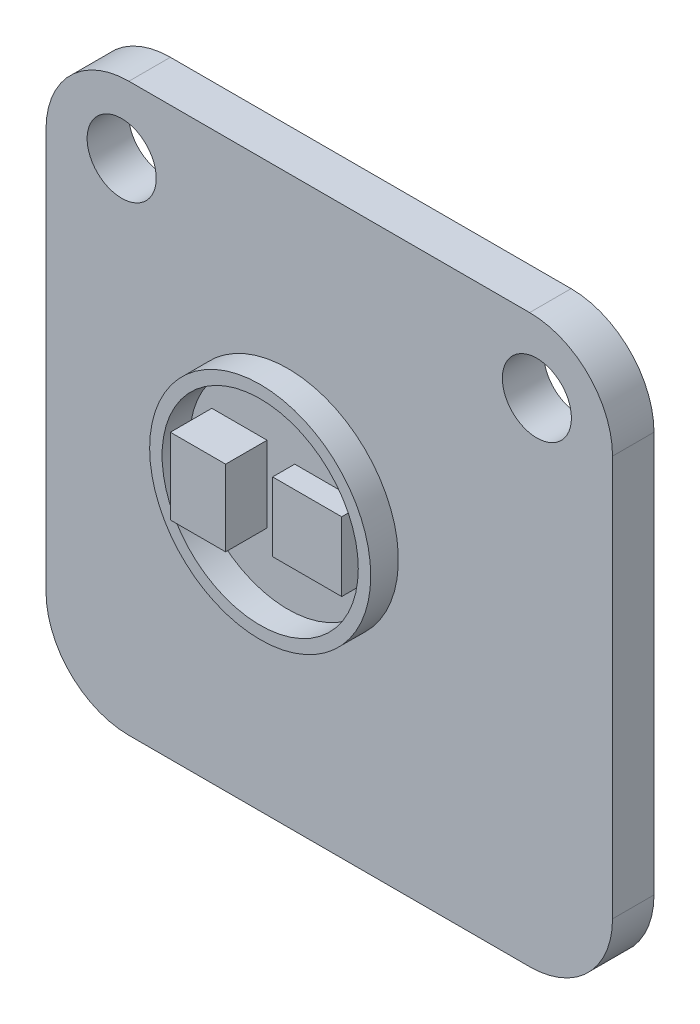
ISO-10303-21;
HEADER;
FILE_DESCRIPTION(('STEP AP214'),'2;1');
FILE_NAME('part.step','',(''),(''),'','','');
FILE_SCHEMA(('AUTOMOTIVE_DESIGN { 1 0 10303 214 1 1 1 1 }'));
ENDSEC;
DATA;
#1=APPLICATION_CONTEXT('core data for automotive mechanical design processes');
#2=APPLICATION_PROTOCOL_DEFINITION('international standard','automotive_design',2000,#1);
#3=PRODUCT_CONTEXT('',#1,'mechanical');
#4=PRODUCT('Part','Part','',(#3));
#5=PRODUCT_RELATED_PRODUCT_CATEGORY('part','',(#4));
#6=PRODUCT_DEFINITION_FORMATION('','',#4);
#7=PRODUCT_DEFINITION_CONTEXT('part definition',#1,'design');
#8=PRODUCT_DEFINITION('design','',#6,#7);
#9=PRODUCT_DEFINITION_SHAPE('','',#8);
#10=(LENGTH_UNIT() NAMED_UNIT(*) SI_UNIT(.MILLI.,.METRE.));
#11=(NAMED_UNIT(*) PLANE_ANGLE_UNIT() SI_UNIT($,.RADIAN.));
#12=(NAMED_UNIT(*) SI_UNIT($,.STERADIAN.) SOLID_ANGLE_UNIT());
#13=UNCERTAINTY_MEASURE_WITH_UNIT(LENGTH_MEASURE(1.E-05),#10,'distance_accuracy_value','');
#14=(GEOMETRIC_REPRESENTATION_CONTEXT(3) GLOBAL_UNCERTAINTY_ASSIGNED_CONTEXT((#13)) GLOBAL_UNIT_ASSIGNED_CONTEXT((#10,
#11,#12)) REPRESENTATION_CONTEXT('',''));
#15=CARTESIAN_POINT('',(0.,0.,0.));
#16=DIRECTION('',(0.,0.,1.));
#17=DIRECTION('',(1.,0.,0.));
#18=AXIS2_PLACEMENT_3D('',#15,#16,#17);
#19=CARTESIAN_POINT('',(0.,0.,1.5));
#20=DIRECTION('',(0.,0.,-1.));
#21=DIRECTION('',(-1.,0.,0.));
#22=AXIS2_PLACEMENT_3D('',#19,#20,#21);
#23=PLANE('',#22);
#24=DIRECTION('',(0.,1.,0.));
#25=VECTOR('',#24,1.);
#26=CARTESIAN_POINT('',(11.5,11.5,1.5));
#27=LINE('',#26,#25);
#28=CARTESIAN_POINT('',(11.5,9.,1.5));
#29=VERTEX_POINT('',#28);
#30=CARTESIAN_POINT('',(11.5,11.5,1.5));
#31=VERTEX_POINT('',#30);
#32=EDGE_CURVE('E173',#29,#31,#27,.T.);
#33=ORIENTED_EDGE('',*,*,#32,.F.);
#34=DIRECTION('',(1.,0.,0.));
#35=VECTOR('',#34,1.);
#36=CARTESIAN_POINT('',(9.,9.,1.5));
#37=LINE('',#36,#35);
#38=CARTESIAN_POINT('',(9.,9.,1.5));
#39=VERTEX_POINT('',#38);
#40=EDGE_CURVE('E199',#39,#29,#37,.T.);
#41=ORIENTED_EDGE('',*,*,#40,.F.);
#42=DIRECTION('',(0.,-1.,0.));
#43=VECTOR('',#42,1.);
#44=CARTESIAN_POINT('',(9.,11.5,1.5));
#45=LINE('',#44,#43);
#46=CARTESIAN_POINT('',(9.,11.5,1.5));
#47=VERTEX_POINT('',#46);
#48=EDGE_CURVE('E211',#47,#39,#45,.T.);
#49=ORIENTED_EDGE('',*,*,#48,.F.);
#50=DIRECTION('',(-1.,0.,0.));
#51=VECTOR('',#50,1.);
#52=CARTESIAN_POINT('',(9.,11.5,1.5));
#53=LINE('',#52,#51);
#54=EDGE_CURVE('E208',#31,#47,#53,.T.);
#55=ORIENTED_EDGE('',*,*,#54,.F.);
#56=EDGE_LOOP('',(#33,#41,#49,#55));
#57=FACE_BOUND('',#56,.T.);
#58=DIRECTION('',(1.,0.,0.));
#59=VECTOR('',#58,1.);
#60=CARTESIAN_POINT('',(6.,9.,1.5));
#61=LINE('',#60,#59);
#62=CARTESIAN_POINT('',(6.,9.,1.5));
#63=VERTEX_POINT('',#62);
#64=CARTESIAN_POINT('',(8.,9.,1.5));
#65=VERTEX_POINT('',#64);
#66=EDGE_CURVE('E171',#63,#65,#61,.T.);
#67=ORIENTED_EDGE('',*,*,#66,.F.);
#68=DIRECTION('',(0.,-1.,0.));
#69=VECTOR('',#68,1.);
#70=CARTESIAN_POINT('',(6.,11.75,1.5));
#71=LINE('',#70,#69);
#72=CARTESIAN_POINT('',(6.,11.75,1.5));
#73=VERTEX_POINT('',#72);
#74=EDGE_CURVE('E166',#73,#63,#71,.T.);
#75=ORIENTED_EDGE('',*,*,#74,.F.);
#76=DIRECTION('',(1.,0.,0.));
#77=VECTOR('',#76,1.);
#78=CARTESIAN_POINT('',(6.,11.75,1.5));
#79=LINE('',#78,#77);
#80=CARTESIAN_POINT('',(8.,11.75,1.5));
#81=VERTEX_POINT('',#80);
#82=EDGE_CURVE('E62',#73,#81,#79,.T.);
#83=ORIENTED_EDGE('',*,*,#82,.T.);
#84=DIRECTION('',(0.,-1.,0.));
#85=VECTOR('',#84,1.);
#86=CARTESIAN_POINT('',(8.,11.75,1.5));
#87=LINE('',#86,#85);
#88=EDGE_CURVE('E57',#81,#65,#87,.T.);
#89=ORIENTED_EDGE('',*,*,#88,.T.);
#90=EDGE_LOOP('',(#67,#75,#83,#89));
#91=FACE_BOUND('',#90,.T.);
#92=CARTESIAN_POINT('',(8.75,10.375,1.5));
#93=DIRECTION('',(0.,0.,1.));
#94=DIRECTION('',(1.,0.,0.));
#95=AXIS2_PLACEMENT_3D('',#92,#93,#94);
#96=CIRCLE('',#95,3.55);
#97=CARTESIAN_POINT('',(12.3,10.375,1.5));
#98=VERTEX_POINT('',#97);
#99=EDGE_CURVE('E333',#98,#98,#96,.T.);
#100=ORIENTED_EDGE('',*,*,#99,.T.);
#101=EDGE_LOOP('',(#100));
#102=FACE_BOUND('',#101,.T.);
#103=ADVANCED_FACE('F42',(#57,#91,#102),#23,.F.);
#104=CARTESIAN_POINT('',(11.5,11.5,2.3));
#105=DIRECTION('',(-1.,0.,0.));
#106=DIRECTION('',(0.,0.,1.));
#107=AXIS2_PLACEMENT_3D('',#104,#105,#106);
#108=PLANE('',#107);
#109=ORIENTED_EDGE('',*,*,#32,.T.);
#110=DIRECTION('',(0.,0.,-1.));
#111=VECTOR('',#110,1.);
#112=CARTESIAN_POINT('',(11.5,11.5,2.3));
#113=LINE('',#112,#111);
#114=CARTESIAN_POINT('',(11.5,11.5,2.3));
#115=VERTEX_POINT('',#114);
#116=EDGE_CURVE('E224',#115,#31,#113,.T.);
#117=ORIENTED_EDGE('',*,*,#116,.F.);
#118=DIRECTION('',(0.,1.,0.));
#119=VECTOR('',#118,1.);
#120=CARTESIAN_POINT('',(11.5,11.5,2.3));
#121=LINE('',#120,#119);
#122=CARTESIAN_POINT('',(11.5,9.,2.3));
#123=VERTEX_POINT('',#122);
#124=EDGE_CURVE('E195',#123,#115,#121,.T.);
#125=ORIENTED_EDGE('',*,*,#124,.F.);
#126=DIRECTION('',(0.,0.,-1.));
#127=VECTOR('',#126,1.);
#128=CARTESIAN_POINT('',(11.5,9.,2.3));
#129=LINE('',#128,#127);
#130=EDGE_CURVE('E205',#123,#29,#129,.T.);
#131=ORIENTED_EDGE('',*,*,#130,.T.);
#132=EDGE_LOOP('',(#109,#117,#125,#131));
#133=FACE_BOUND('',#132,.T.);
#134=ADVANCED_FACE('F322',(#133),#108,.F.);
#135=CARTESIAN_POINT('',(9.,11.5,2.3));
#136=DIRECTION('',(0.,-1.,0.));
#137=DIRECTION('',(0.,0.,-1.));
#138=AXIS2_PLACEMENT_3D('',#135,#136,#137);
#139=PLANE('',#138);
#140=ORIENTED_EDGE('',*,*,#54,.T.);
#141=DIRECTION('',(0.,0.,-1.));
#142=VECTOR('',#141,1.);
#143=CARTESIAN_POINT('',(9.,11.5,2.3));
#144=LINE('',#143,#142);
#145=CARTESIAN_POINT('',(9.,11.5,2.3));
#146=VERTEX_POINT('',#145);
#147=EDGE_CURVE('E221',#146,#47,#144,.T.);
#148=ORIENTED_EDGE('',*,*,#147,.F.);
#149=DIRECTION('',(-1.,0.,0.));
#150=VECTOR('',#149,1.);
#151=CARTESIAN_POINT('',(9.,11.5,2.3));
#152=LINE('',#151,#150);
#153=EDGE_CURVE('E198',#115,#146,#152,.T.);
#154=ORIENTED_EDGE('',*,*,#153,.F.);
#155=ORIENTED_EDGE('',*,*,#116,.T.);
#156=EDGE_LOOP('',(#140,#148,#154,#155));
#157=FACE_BOUND('',#156,.T.);
#158=ADVANCED_FACE('F327',(#157),#139,.F.);
#159=CARTESIAN_POINT('',(9.,11.5,2.3));
#160=DIRECTION('',(1.,0.,0.));
#161=DIRECTION('',(0.,0.,-1.));
#162=AXIS2_PLACEMENT_3D('',#159,#160,#161);
#163=PLANE('',#162);
#164=ORIENTED_EDGE('',*,*,#48,.T.);
#165=DIRECTION('',(0.,0.,-1.));
#166=VECTOR('',#165,1.);
#167=CARTESIAN_POINT('',(9.,9.,2.3));
#168=LINE('',#167,#166);
#169=CARTESIAN_POINT('',(9.,9.,2.3));
#170=VERTEX_POINT('',#169);
#171=EDGE_CURVE('E218',#170,#39,#168,.T.);
#172=ORIENTED_EDGE('',*,*,#171,.F.);
#173=DIRECTION('',(0.,-1.,0.));
#174=VECTOR('',#173,1.);
#175=CARTESIAN_POINT('',(9.,11.5,2.3));
#176=LINE('',#175,#174);
#177=EDGE_CURVE('E201',#146,#170,#176,.T.);
#178=ORIENTED_EDGE('',*,*,#177,.F.);
#179=ORIENTED_EDGE('',*,*,#147,.T.);
#180=EDGE_LOOP('',(#164,#172,#178,#179));
#181=FACE_BOUND('',#180,.T.);
#182=ADVANCED_FACE('F379',(#181),#163,.F.);
#183=CARTESIAN_POINT('',(9.,9.,2.3));
#184=DIRECTION('',(0.,1.,0.));
#185=DIRECTION('',(0.,0.,1.));
#186=AXIS2_PLACEMENT_3D('',#183,#184,#185);
#187=PLANE('',#186);
#188=ORIENTED_EDGE('',*,*,#40,.T.);
#189=ORIENTED_EDGE('',*,*,#130,.F.);
#190=DIRECTION('',(1.,0.,0.));
#191=VECTOR('',#190,1.);
#192=CARTESIAN_POINT('',(9.,9.,2.3));
#193=LINE('',#192,#191);
#194=EDGE_CURVE('E203',#170,#123,#193,.T.);
#195=ORIENTED_EDGE('',*,*,#194,.F.);
#196=ORIENTED_EDGE('',*,*,#171,.T.);
#197=EDGE_LOOP('',(#188,#189,#195,#196));
#198=FACE_BOUND('',#197,.T.);
#199=ADVANCED_FACE('F375',(#198),#187,.F.);
#200=CARTESIAN_POINT('',(0.,0.,2.3));
#201=DIRECTION('',(0.,0.,1.));
#202=DIRECTION('',(1.,0.,0.));
#203=AXIS2_PLACEMENT_3D('',#200,#201,#202);
#204=PLANE('',#203);
#205=ORIENTED_EDGE('',*,*,#124,.T.);
#206=ORIENTED_EDGE('',*,*,#153,.T.);
#207=ORIENTED_EDGE('',*,*,#177,.T.);
#208=ORIENTED_EDGE('',*,*,#194,.T.);
#209=EDGE_LOOP('',(#205,#206,#207,#208));
#210=FACE_BOUND('',#209,.T.);
#211=ADVANCED_FACE('F372',(#210),#204,.T.);
#212=CARTESIAN_POINT('',(6.,9.,3.));
#213=DIRECTION('',(0.,1.,0.));
#214=DIRECTION('',(0.,0.,1.));
#215=AXIS2_PLACEMENT_3D('',#212,#213,#214);
#216=PLANE('',#215);
#217=ORIENTED_EDGE('',*,*,#66,.T.);
#218=DIRECTION('',(0.,0.,-1.));
#219=VECTOR('',#218,1.);
#220=CARTESIAN_POINT('',(8.,9.,3.));
#221=LINE('',#220,#219);
#222=CARTESIAN_POINT('',(8.,9.,3.));
#223=VERTEX_POINT('',#222);
#224=EDGE_CURVE('E169',#223,#65,#221,.T.);
#225=ORIENTED_EDGE('',*,*,#224,.F.);
#226=DIRECTION('',(1.,0.,0.));
#227=VECTOR('',#226,1.);
#228=CARTESIAN_POINT('',(6.,9.,3.));
#229=LINE('',#228,#227);
#230=CARTESIAN_POINT('',(6.,9.,3.));
#231=VERTEX_POINT('',#230);
#232=EDGE_CURVE('E154',#231,#223,#229,.T.);
#233=ORIENTED_EDGE('',*,*,#232,.F.);
#234=DIRECTION('',(0.,0.,-1.));
#235=VECTOR('',#234,1.);
#236=CARTESIAN_POINT('',(6.,9.,3.));
#237=LINE('',#236,#235);
#238=EDGE_CURVE('E183',#231,#63,#237,.T.);
#239=ORIENTED_EDGE('',*,*,#238,.T.);
#240=EDGE_LOOP('',(#217,#225,#233,#239));
#241=FACE_BOUND('',#240,.T.);
#242=ADVANCED_FACE('F170',(#241),#216,.F.);
#243=CARTESIAN_POINT('',(8.,11.75,3.));
#244=DIRECTION('',(1.,0.,0.));
#245=DIRECTION('',(0.,1.,0.));
#246=AXIS2_PLACEMENT_3D('',#243,#244,#245);
#247=PLANE('',#246);
#248=ORIENTED_EDGE('',*,*,#88,.F.);
#249=DIRECTION('',(0.,0.,-1.));
#250=VECTOR('',#249,1.);
#251=CARTESIAN_POINT('',(8.,11.75,3.));
#252=LINE('',#251,#250);
#253=CARTESIAN_POINT('',(8.,11.75,3.));
#254=VERTEX_POINT('',#253);
#255=EDGE_CURVE('E174',#254,#81,#252,.T.);
#256=ORIENTED_EDGE('',*,*,#255,.F.);
#257=DIRECTION('',(0.,-1.,0.));
#258=VECTOR('',#257,1.);
#259=CARTESIAN_POINT('',(8.,11.75,3.));
#260=LINE('',#259,#258);
#261=EDGE_CURVE('E159',#254,#223,#260,.T.);
#262=ORIENTED_EDGE('',*,*,#261,.T.);
#263=ORIENTED_EDGE('',*,*,#224,.T.);
#264=EDGE_LOOP('',(#248,#256,#262,#263));
#265=FACE_BOUND('',#264,.T.);
#266=ADVANCED_FACE('F176',(#265),#247,.T.);
#267=CARTESIAN_POINT('',(6.,11.75,3.));
#268=DIRECTION('',(0.,1.,0.));
#269=DIRECTION('',(0.,0.,1.));
#270=AXIS2_PLACEMENT_3D('',#267,#268,#269);
#271=PLANE('',#270);
#272=ORIENTED_EDGE('',*,*,#82,.F.);
#273=DIRECTION('',(0.,0.,-1.));
#274=VECTOR('',#273,1.);
#275=CARTESIAN_POINT('',(6.,11.75,3.));
#276=LINE('',#275,#274);
#277=CARTESIAN_POINT('',(6.,11.75,3.));
#278=VERTEX_POINT('',#277);
#279=EDGE_CURVE('E191',#278,#73,#276,.T.);
#280=ORIENTED_EDGE('',*,*,#279,.F.);
#281=DIRECTION('',(1.,0.,0.));
#282=VECTOR('',#281,1.);
#283=CARTESIAN_POINT('',(6.,11.75,3.));
#284=LINE('',#283,#282);
#285=EDGE_CURVE('E177',#278,#254,#284,.T.);
#286=ORIENTED_EDGE('',*,*,#285,.T.);
#287=ORIENTED_EDGE('',*,*,#255,.T.);
#288=EDGE_LOOP('',(#272,#280,#286,#287));
#289=FACE_BOUND('',#288,.T.);
#290=ADVANCED_FACE('F363',(#289),#271,.T.);
#291=CARTESIAN_POINT('',(6.,11.75,3.));
#292=DIRECTION('',(1.,0.,0.));
#293=DIRECTION('',(0.,0.,-1.));
#294=AXIS2_PLACEMENT_3D('',#291,#292,#293);
#295=PLANE('',#294);
#296=ORIENTED_EDGE('',*,*,#74,.T.);
#297=ORIENTED_EDGE('',*,*,#238,.F.);
#298=DIRECTION('',(0.,-1.,0.));
#299=VECTOR('',#298,1.);
#300=CARTESIAN_POINT('',(6.,11.75,3.));
#301=LINE('',#300,#299);
#302=EDGE_CURVE('E162',#278,#231,#301,.T.);
#303=ORIENTED_EDGE('',*,*,#302,.F.);
#304=ORIENTED_EDGE('',*,*,#279,.T.);
#305=EDGE_LOOP('',(#296,#297,#303,#304));
#306=FACE_BOUND('',#305,.T.);
#307=ADVANCED_FACE('F360',(#306),#295,.F.);
#308=CARTESIAN_POINT('',(0.,0.,3.));
#309=DIRECTION('',(0.,0.,-1.));
#310=DIRECTION('',(-1.,0.,0.));
#311=AXIS2_PLACEMENT_3D('',#308,#309,#310);
#312=PLANE('',#311);
#313=ORIENTED_EDGE('',*,*,#232,.T.);
#314=ORIENTED_EDGE('',*,*,#261,.F.);
#315=ORIENTED_EDGE('',*,*,#285,.F.);
#316=ORIENTED_EDGE('',*,*,#302,.T.);
#317=EDGE_LOOP('',(#313,#314,#315,#316));
#318=FACE_BOUND('',#317,.T.);
#319=ADVANCED_FACE('F156',(#318),#312,.F.);
#320=CARTESIAN_POINT('',(8.75,10.375,2.5));
#321=DIRECTION('',(0.,0.,-1.));
#322=DIRECTION('',(-1.,0.,0.));
#323=AXIS2_PLACEMENT_3D('',#320,#321,#322);
#324=CYLINDRICAL_SURFACE('',#323,3.55);
#325=CARTESIAN_POINT('',(8.75,10.375,2.5));
#326=DIRECTION('',(0.,0.,1.));
#327=DIRECTION('',(1.,0.,0.));
#328=AXIS2_PLACEMENT_3D('',#325,#326,#327);
#329=CIRCLE('',#328,3.55);
#330=CARTESIAN_POINT('',(12.3,10.375,2.5));
#331=VERTEX_POINT('',#330);
#332=EDGE_CURVE('E335',#331,#331,#329,.T.);
#333=ORIENTED_EDGE('',*,*,#332,.T.);
#334=EDGE_LOOP('',(#333));
#335=FACE_BOUND('',#334,.T.);
#336=ORIENTED_EDGE('',*,*,#99,.F.);
#337=EDGE_LOOP('',(#336));
#338=FACE_BOUND('',#337,.T.);
#339=ADVANCED_FACE('F347',(#335,#338),#324,.F.);
#340=CARTESIAN_POINT('',(8.75,10.375,2.5));
#341=DIRECTION('',(0.,0.,-1.));
#342=DIRECTION('',(-1.,0.,0.));
#343=AXIS2_PLACEMENT_3D('',#340,#341,#342);
#344=CYLINDRICAL_SURFACE('',#343,4.);
#345=CARTESIAN_POINT('',(8.75,10.375,2.5));
#346=DIRECTION('',(0.,0.,1.));
#347=DIRECTION('',(1.,0.,0.));
#348=AXIS2_PLACEMENT_3D('',#345,#346,#347);
#349=CIRCLE('',#348,4.);
#350=CARTESIAN_POINT('',(12.75,10.375,2.5));
#351=VERTEX_POINT('',#350);
#352=EDGE_CURVE('E185',#351,#351,#349,.T.);
#353=ORIENTED_EDGE('',*,*,#352,.F.);
#354=EDGE_LOOP('',(#353));
#355=FACE_BOUND('',#354,.T.);
#356=CARTESIAN_POINT('',(8.75,10.375,1.5));
#357=DIRECTION('',(0.,0.,-1.));
#358=DIRECTION('',(-1.,0.,0.));
#359=AXIS2_PLACEMENT_3D('',#356,#357,#358);
#360=CIRCLE('',#359,4.);
#361=CARTESIAN_POINT('',(4.75,10.375,1.5));
#362=VERTEX_POINT('',#361);
#363=EDGE_CURVE('E11',#362,#362,#360,.F.);
#364=ORIENTED_EDGE('',*,*,#363,.T.);
#365=EDGE_LOOP('',(#364));
#366=FACE_BOUND('',#365,.T.);
#367=ADVANCED_FACE('F344',(#355,#366),#344,.T.);
#368=CARTESIAN_POINT('',(0.,0.,2.5));
#369=DIRECTION('',(0.,0.,1.));
#370=DIRECTION('',(1.,0.,0.));
#371=AXIS2_PLACEMENT_3D('',#368,#369,#370);
#372=PLANE('',#371);
#373=ORIENTED_EDGE('',*,*,#332,.F.);
#374=EDGE_LOOP('',(#373));
#375=FACE_BOUND('',#374,.T.);
#376=ORIENTED_EDGE('',*,*,#352,.T.);
#377=EDGE_LOOP('',(#376));
#378=FACE_BOUND('',#377,.T.);
#379=ADVANCED_FACE('F342',(#375,#378),#372,.T.);
#380=CARTESIAN_POINT('',(0.,0.,0.));
#381=DIRECTION('',(0.,0.,-1.));
#382=DIRECTION('',(-1.,0.,0.));
#383=AXIS2_PLACEMENT_3D('',#380,#381,#382);
#384=PLANE('',#383);
#385=DIRECTION('',(0.,1.,0.));
#386=VECTOR('',#385,1.);
#387=CARTESIAN_POINT('',(20.5,0.,0.));
#388=LINE('',#387,#386);
#389=CARTESIAN_POINT('',(20.5,3.,0.));
#390=VERTEX_POINT('',#389);
#391=CARTESIAN_POINT('',(20.5,17.5,0.));
#392=VERTEX_POINT('',#391);
#393=EDGE_CURVE('E255',#390,#392,#388,.T.);
#394=ORIENTED_EDGE('',*,*,#393,.F.);
#395=CARTESIAN_POINT('',(17.5,3.,0.));
#396=DIRECTION('',(0.,0.,-1.));
#397=DIRECTION('',(-1.,0.,0.));
#398=AXIS2_PLACEMENT_3D('',#395,#396,#397);
#399=CIRCLE('',#398,3.);
#400=CARTESIAN_POINT('',(17.5,0.,0.));
#401=VERTEX_POINT('',#400);
#402=EDGE_CURVE('E270',#390,#401,#399,.T.);
#403=ORIENTED_EDGE('',*,*,#402,.T.);
#404=DIRECTION('',(1.,0.,0.));
#405=VECTOR('',#404,1.);
#406=CARTESIAN_POINT('',(0.,0.,0.));
#407=LINE('',#406,#405);
#408=CARTESIAN_POINT('',(3.,0.,0.));
#409=VERTEX_POINT('',#408);
#410=EDGE_CURVE('E251',#409,#401,#407,.T.);
#411=ORIENTED_EDGE('',*,*,#410,.F.);
#412=CARTESIAN_POINT('',(3.,3.,0.));
#413=DIRECTION('',(0.,0.,-1.));
#414=DIRECTION('',(-1.,0.,0.));
#415=AXIS2_PLACEMENT_3D('',#412,#413,#414);
#416=CIRCLE('',#415,3.);
#417=CARTESIAN_POINT('',(0.,3.,0.));
#418=VERTEX_POINT('',#417);
#419=EDGE_CURVE('E268',#409,#418,#416,.T.);
#420=ORIENTED_EDGE('',*,*,#419,.T.);
#421=DIRECTION('',(0.,-1.,0.));
#422=VECTOR('',#421,1.);
#423=CARTESIAN_POINT('',(0.,0.,0.));
#424=LINE('',#423,#422);
#425=CARTESIAN_POINT('',(0.,17.5,0.));
#426=VERTEX_POINT('',#425);
#427=EDGE_CURVE('E248',#426,#418,#424,.T.);
#428=ORIENTED_EDGE('',*,*,#427,.F.);
#429=CARTESIAN_POINT('',(3.,17.5,0.));
#430=DIRECTION('',(0.,0.,-1.));
#431=DIRECTION('',(-1.,0.,0.));
#432=AXIS2_PLACEMENT_3D('',#429,#430,#431);
#433=CIRCLE('',#432,3.);
#434=CARTESIAN_POINT('',(3.,20.5,0.));
#435=VERTEX_POINT('',#434);
#436=EDGE_CURVE('E264',#426,#435,#433,.T.);
#437=ORIENTED_EDGE('',*,*,#436,.T.);
#438=DIRECTION('',(-1.,0.,0.));
#439=VECTOR('',#438,1.);
#440=CARTESIAN_POINT('',(0.,20.5,0.));
#441=LINE('',#440,#439);
#442=CARTESIAN_POINT('',(17.5,20.5,0.));
#443=VERTEX_POINT('',#442);
#444=EDGE_CURVE('E238',#443,#435,#441,.T.);
#445=ORIENTED_EDGE('',*,*,#444,.F.);
#446=CARTESIAN_POINT('',(17.5,17.5,0.));
#447=DIRECTION('',(0.,0.,-1.));
#448=DIRECTION('',(-1.,0.,0.));
#449=AXIS2_PLACEMENT_3D('',#446,#447,#448);
#450=CIRCLE('',#449,3.);
#451=EDGE_CURVE('E266',#443,#392,#450,.T.);
#452=ORIENTED_EDGE('',*,*,#451,.T.);
#453=EDGE_LOOP('',(#394,#403,#411,#420,#428,#437,#445,#452));
#454=FACE_BOUND('',#453,.T.);
#455=CARTESIAN_POINT('',(2.73789677910346,17.95,0.));
#456=DIRECTION('',(0.,0.,-1.));
#457=DIRECTION('',(-1.,0.,0.));
#458=AXIS2_PLACEMENT_3D('',#455,#456,#457);
#459=CIRCLE('',#458,1.25);
#460=CARTESIAN_POINT('',(1.48789677910346,17.95,0.));
#461=VERTEX_POINT('',#460);
#462=EDGE_CURVE('E231',#461,#461,#459,.T.);
#463=ORIENTED_EDGE('',*,*,#462,.F.);
#464=EDGE_LOOP('',(#463));
#465=FACE_BOUND('',#464,.T.);
#466=CARTESIAN_POINT('',(17.7621032208965,17.95,0.));
#467=DIRECTION('',(0.,0.,-1.));
#468=DIRECTION('',(-1.,0.,0.));
#469=AXIS2_PLACEMENT_3D('',#466,#467,#468);
#470=CIRCLE('',#469,1.25);
#471=CARTESIAN_POINT('',(16.5121032208965,17.95,0.));
#472=VERTEX_POINT('',#471);
#473=EDGE_CURVE('E252',#472,#472,#470,.F.);
#474=ORIENTED_EDGE('',*,*,#473,.T.);
#475=EDGE_LOOP('',(#474));
#476=FACE_BOUND('',#475,.T.);
#477=ADVANCED_FACE('F298',(#454,#465,#476),#384,.T.);
#478=CARTESIAN_POINT('',(17.7621032208965,17.95,-3.));
#479=DIRECTION('',(0.,0.,1.));
#480=DIRECTION('',(1.,0.,0.));
#481=AXIS2_PLACEMENT_3D('',#478,#479,#480);
#482=CYLINDRICAL_SURFACE('',#481,1.25);
#483=ORIENTED_EDGE('',*,*,#473,.F.);
#484=EDGE_LOOP('',(#483));
#485=FACE_BOUND('',#484,.T.);
#486=CARTESIAN_POINT('',(17.7621032208965,17.95,1.5));
#487=DIRECTION('',(0.,0.,1.));
#488=DIRECTION('',(1.,0.,0.));
#489=AXIS2_PLACEMENT_3D('',#486,#487,#488);
#490=CIRCLE('',#489,1.25);
#491=CARTESIAN_POINT('',(19.0121032208965,17.95,1.5));
#492=VERTEX_POINT('',#491);
#493=EDGE_CURVE('E228',#492,#492,#490,.F.);
#494=ORIENTED_EDGE('',*,*,#493,.F.);
#495=EDGE_LOOP('',(#494));
#496=FACE_BOUND('',#495,.T.);
#497=ADVANCED_FACE('F300',(#485,#496),#482,.F.);
#498=CARTESIAN_POINT('',(3.,3.,1.5));
#499=DIRECTION('',(0.,0.,-1.));
#500=DIRECTION('',(-1.,0.,0.));
#501=AXIS2_PLACEMENT_3D('',#498,#499,#500);
#502=CYLINDRICAL_SURFACE('',#501,3.);
#503=CARTESIAN_POINT('',(3.,3.,1.5));
#504=DIRECTION('',(0.,0.,-1.));
#505=DIRECTION('',(-1.,0.,0.));
#506=AXIS2_PLACEMENT_3D('',#503,#504,#505);
#507=CIRCLE('',#506,3.);
#508=CARTESIAN_POINT('',(0.,3.,1.5));
#509=VERTEX_POINT('',#508);
#510=CARTESIAN_POINT('',(3.,0.,1.5));
#511=VERTEX_POINT('',#510);
#512=EDGE_CURVE('E281',#509,#511,#507,.F.);
#513=ORIENTED_EDGE('',*,*,#512,.F.);
#514=DIRECTION('',(0.,0.,-1.));
#515=VECTOR('',#514,1.);
#516=CARTESIAN_POINT('',(0.,3.,1.5));
#517=LINE('',#516,#515);
#518=EDGE_CURVE('E288',#418,#509,#517,.F.);
#519=ORIENTED_EDGE('',*,*,#518,.F.);
#520=ORIENTED_EDGE('',*,*,#419,.F.);
#521=DIRECTION('',(0.,0.,-1.));
#522=VECTOR('',#521,1.);
#523=CARTESIAN_POINT('',(3.,0.,1.5));
#524=LINE('',#523,#522);
#525=EDGE_CURVE('E272',#511,#409,#524,.T.);
#526=ORIENTED_EDGE('',*,*,#525,.F.);
#527=EDGE_LOOP('',(#513,#519,#520,#526));
#528=FACE_BOUND('',#527,.T.);
#529=ADVANCED_FACE('F303',(#528),#502,.T.);
#530=CARTESIAN_POINT('',(0.,0.,1.5));
#531=DIRECTION('',(1.,0.,0.));
#532=DIRECTION('',(0.,1.,0.));
#533=AXIS2_PLACEMENT_3D('',#530,#531,#532);
#534=PLANE('',#533);
#535=ORIENTED_EDGE('',*,*,#427,.T.);
#536=ORIENTED_EDGE('',*,*,#518,.T.);
#537=DIRECTION('',(0.,-1.,0.));
#538=VECTOR('',#537,1.);
#539=CARTESIAN_POINT('',(0.,0.,1.5));
#540=LINE('',#539,#538);
#541=CARTESIAN_POINT('',(0.,17.5,1.5));
#542=VERTEX_POINT('',#541);
#543=EDGE_CURVE('E234',#542,#509,#540,.T.);
#544=ORIENTED_EDGE('',*,*,#543,.F.);
#545=DIRECTION('',(0.,0.,-1.));
#546=VECTOR('',#545,1.);
#547=CARTESIAN_POINT('',(0.,17.5,1.5));
#548=LINE('',#547,#546);
#549=EDGE_CURVE('E285',#542,#426,#548,.T.);
#550=ORIENTED_EDGE('',*,*,#549,.T.);
#551=EDGE_LOOP('',(#535,#536,#544,#550));
#552=FACE_BOUND('',#551,.T.);
#553=ADVANCED_FACE('F505',(#552),#534,.F.);
#554=CARTESIAN_POINT('',(3.,17.5,1.5));
#555=DIRECTION('',(0.,0.,-1.));
#556=DIRECTION('',(-1.,0.,0.));
#557=AXIS2_PLACEMENT_3D('',#554,#555,#556);
#558=CYLINDRICAL_SURFACE('',#557,3.);
#559=CARTESIAN_POINT('',(3.,17.5,1.5));
#560=DIRECTION('',(0.,0.,-1.));
#561=DIRECTION('',(-1.,0.,0.));
#562=AXIS2_PLACEMENT_3D('',#559,#560,#561);
#563=CIRCLE('',#562,3.);
#564=CARTESIAN_POINT('',(3.,20.5,1.5));
#565=VERTEX_POINT('',#564);
#566=EDGE_CURVE('E277',#565,#542,#563,.F.);
#567=ORIENTED_EDGE('',*,*,#566,.F.);
#568=DIRECTION('',(0.,0.,-1.));
#569=VECTOR('',#568,1.);
#570=CARTESIAN_POINT('',(3.,20.5,1.5));
#571=LINE('',#570,#569);
#572=EDGE_CURVE('E290',#435,#565,#571,.F.);
#573=ORIENTED_EDGE('',*,*,#572,.F.);
#574=ORIENTED_EDGE('',*,*,#436,.F.);
#575=ORIENTED_EDGE('',*,*,#549,.F.);
#576=EDGE_LOOP('',(#567,#573,#574,#575));
#577=FACE_BOUND('',#576,.T.);
#578=ADVANCED_FACE('F44',(#577),#558,.T.);
#579=CARTESIAN_POINT('',(0.,20.5,1.5));
#580=DIRECTION('',(0.,-1.,0.));
#581=DIRECTION('',(0.,0.,-1.));
#582=AXIS2_PLACEMENT_3D('',#579,#580,#581);
#583=PLANE('',#582);
#584=DIRECTION('',(-1.,0.,0.));
#585=VECTOR('',#584,1.);
#586=CARTESIAN_POINT('',(0.,20.5,1.5));
#587=LINE('',#586,#585);
#588=CARTESIAN_POINT('',(17.5,20.5,1.5));
#589=VERTEX_POINT('',#588);
#590=EDGE_CURVE('E244',#589,#565,#587,.T.);
#591=ORIENTED_EDGE('',*,*,#590,.F.);
#592=DIRECTION('',(0.,0.,-1.));
#593=VECTOR('',#592,1.);
#594=CARTESIAN_POINT('',(17.5,20.5,1.5));
#595=LINE('',#594,#593);
#596=EDGE_CURVE('E50',#589,#443,#595,.T.);
#597=ORIENTED_EDGE('',*,*,#596,.T.);
#598=ORIENTED_EDGE('',*,*,#444,.T.);
#599=ORIENTED_EDGE('',*,*,#572,.T.);
#600=EDGE_LOOP('',(#591,#597,#598,#599));
#601=FACE_BOUND('',#600,.T.);
#602=ADVANCED_FACE('F504',(#601),#583,.F.);
#603=CARTESIAN_POINT('',(17.5,17.5,1.5));
#604=DIRECTION('',(0.,0.,-1.));
#605=DIRECTION('',(-1.,0.,0.));
#606=AXIS2_PLACEMENT_3D('',#603,#604,#605);
#607=CYLINDRICAL_SURFACE('',#606,3.);
#608=CARTESIAN_POINT('',(17.5,17.5,1.5));
#609=DIRECTION('',(0.,0.,-1.));
#610=DIRECTION('',(-1.,0.,0.));
#611=AXIS2_PLACEMENT_3D('',#608,#609,#610);
#612=CIRCLE('',#611,3.);
#613=CARTESIAN_POINT('',(20.5,17.5,1.5));
#614=VERTEX_POINT('',#613);
#615=EDGE_CURVE('E279',#614,#589,#612,.F.);
#616=ORIENTED_EDGE('',*,*,#615,.F.);
#617=DIRECTION('',(0.,0.,-1.));
#618=VECTOR('',#617,1.);
#619=CARTESIAN_POINT('',(20.5,17.5,1.5));
#620=LINE('',#619,#618);
#621=EDGE_CURVE('E247',#392,#614,#620,.F.);
#622=ORIENTED_EDGE('',*,*,#621,.F.);
#623=ORIENTED_EDGE('',*,*,#451,.F.);
#624=ORIENTED_EDGE('',*,*,#596,.F.);
#625=EDGE_LOOP('',(#616,#622,#623,#624));
#626=FACE_BOUND('',#625,.T.);
#627=ADVANCED_FACE('F509',(#626),#607,.T.);
#628=CARTESIAN_POINT('',(20.5,0.,1.5));
#629=DIRECTION('',(-1.,0.,0.));
#630=DIRECTION('',(0.,-1.,0.));
#631=AXIS2_PLACEMENT_3D('',#628,#629,#630);
#632=PLANE('',#631);
#633=DIRECTION('',(0.,1.,0.));
#634=VECTOR('',#633,1.);
#635=CARTESIAN_POINT('',(20.5,0.,1.5));
#636=LINE('',#635,#634);
#637=CARTESIAN_POINT('',(20.5,3.,1.5));
#638=VERTEX_POINT('',#637);
#639=EDGE_CURVE('E241',#638,#614,#636,.T.);
#640=ORIENTED_EDGE('',*,*,#639,.F.);
#641=DIRECTION('',(0.,0.,-1.));
#642=VECTOR('',#641,1.);
#643=CARTESIAN_POINT('',(20.5,3.,1.5));
#644=LINE('',#643,#642);
#645=EDGE_CURVE('E261',#638,#390,#644,.T.);
#646=ORIENTED_EDGE('',*,*,#645,.T.);
#647=ORIENTED_EDGE('',*,*,#393,.T.);
#648=ORIENTED_EDGE('',*,*,#621,.T.);
#649=EDGE_LOOP('',(#640,#646,#647,#648));
#650=FACE_BOUND('',#649,.T.);
#651=ADVANCED_FACE('F514',(#650),#632,.F.);
#652=CARTESIAN_POINT('',(17.5,3.,1.5));
#653=DIRECTION('',(0.,0.,-1.));
#654=DIRECTION('',(-1.,0.,0.));
#655=AXIS2_PLACEMENT_3D('',#652,#653,#654);
#656=CYLINDRICAL_SURFACE('',#655,3.);
#657=CARTESIAN_POINT('',(17.5,3.,1.5));
#658=DIRECTION('',(0.,0.,-1.));
#659=DIRECTION('',(-1.,0.,0.));
#660=AXIS2_PLACEMENT_3D('',#657,#658,#659);
#661=CIRCLE('',#660,3.);
#662=CARTESIAN_POINT('',(17.5,0.,1.5));
#663=VERTEX_POINT('',#662);
#664=EDGE_CURVE('E283',#663,#638,#661,.F.);
#665=ORIENTED_EDGE('',*,*,#664,.F.);
#666=DIRECTION('',(0.,0.,-1.));
#667=VECTOR('',#666,1.);
#668=CARTESIAN_POINT('',(17.5,0.,1.5));
#669=LINE('',#668,#667);
#670=EDGE_CURVE('E275',#401,#663,#669,.F.);
#671=ORIENTED_EDGE('',*,*,#670,.F.);
#672=ORIENTED_EDGE('',*,*,#402,.F.);
#673=ORIENTED_EDGE('',*,*,#645,.F.);
#674=EDGE_LOOP('',(#665,#671,#672,#673));
#675=FACE_BOUND('',#674,.T.);
#676=ADVANCED_FACE('F526',(#675),#656,.T.);
#677=CARTESIAN_POINT('',(0.,0.,1.5));
#678=DIRECTION('',(0.,1.,0.));
#679=DIRECTION('',(0.,0.,1.));
#680=AXIS2_PLACEMENT_3D('',#677,#678,#679);
#681=PLANE('',#680);
#682=ORIENTED_EDGE('',*,*,#410,.T.);
#683=ORIENTED_EDGE('',*,*,#670,.T.);
#684=DIRECTION('',(1.,0.,0.));
#685=VECTOR('',#684,1.);
#686=CARTESIAN_POINT('',(0.,0.,1.5));
#687=LINE('',#686,#685);
#688=EDGE_CURVE('E237',#511,#663,#687,.T.);
#689=ORIENTED_EDGE('',*,*,#688,.F.);
#690=ORIENTED_EDGE('',*,*,#525,.T.);
#691=EDGE_LOOP('',(#682,#683,#689,#690));
#692=FACE_BOUND('',#691,.T.);
#693=ADVANCED_FACE('F315',(#692),#681,.F.);
#694=CARTESIAN_POINT('',(2.73789677910346,17.95,-3.));
#695=DIRECTION('',(0.,0.,1.));
#696=DIRECTION('',(1.,0.,0.));
#697=AXIS2_PLACEMENT_3D('',#694,#695,#696);
#698=CYLINDRICAL_SURFACE('',#697,1.25);
#699=ORIENTED_EDGE('',*,*,#462,.T.);
#700=EDGE_LOOP('',(#699));
#701=FACE_BOUND('',#700,.T.);
#702=CARTESIAN_POINT('',(2.73789677910346,17.95,1.5));
#703=DIRECTION('',(0.,0.,1.));
#704=DIRECTION('',(1.,0.,0.));
#705=AXIS2_PLACEMENT_3D('',#702,#703,#704);
#706=CIRCLE('',#705,1.25);
#707=CARTESIAN_POINT('',(3.98789677910346,17.95,1.5));
#708=VERTEX_POINT('',#707);
#709=EDGE_CURVE('E227',#708,#708,#706,.T.);
#710=ORIENTED_EDGE('',*,*,#709,.T.);
#711=EDGE_LOOP('',(#710));
#712=FACE_BOUND('',#711,.T.);
#713=ADVANCED_FACE('F309',(#701,#712),#698,.F.);
#714=ORIENTED_EDGE('',*,*,#363,.F.);
#715=EDGE_LOOP('',(#714));
#716=FACE_BOUND('',#715,.T.);
#717=ORIENTED_EDGE('',*,*,#709,.F.);
#718=EDGE_LOOP('',(#717));
#719=FACE_BOUND('',#718,.T.);
#720=ORIENTED_EDGE('',*,*,#688,.T.);
#721=ORIENTED_EDGE('',*,*,#664,.T.);
#722=ORIENTED_EDGE('',*,*,#639,.T.);
#723=ORIENTED_EDGE('',*,*,#615,.T.);
#724=ORIENTED_EDGE('',*,*,#590,.T.);
#725=ORIENTED_EDGE('',*,*,#566,.T.);
#726=ORIENTED_EDGE('',*,*,#543,.T.);
#727=ORIENTED_EDGE('',*,*,#512,.T.);
#728=EDGE_LOOP('',(#720,#721,#722,#723,#724,#725,#726,#727));
#729=FACE_BOUND('',#728,.T.);
#730=ORIENTED_EDGE('',*,*,#493,.T.);
#731=EDGE_LOOP('',(#730));
#732=FACE_BOUND('',#731,.T.);
#733=ADVANCED_FACE('F307',(#716,#719,#729,#732),#23,.F.);
#734=CLOSED_SHELL('',(#103,#134,#158,#182,#199,#211,#242,#266,#290,#307,#319,#339,#367,#379,
#477,#497,#529,#553,#578,#602,#627,#651,#676,#693,#713,#733));
#735=MANIFOLD_SOLID_BREP('B2',#734);
#736=ADVANCED_BREP_SHAPE_REPRESENTATION('',(#18,#735),#14);
#737=SHAPE_DEFINITION_REPRESENTATION(#9,#736);
ENDSEC;
END-ISO-10303-21;
